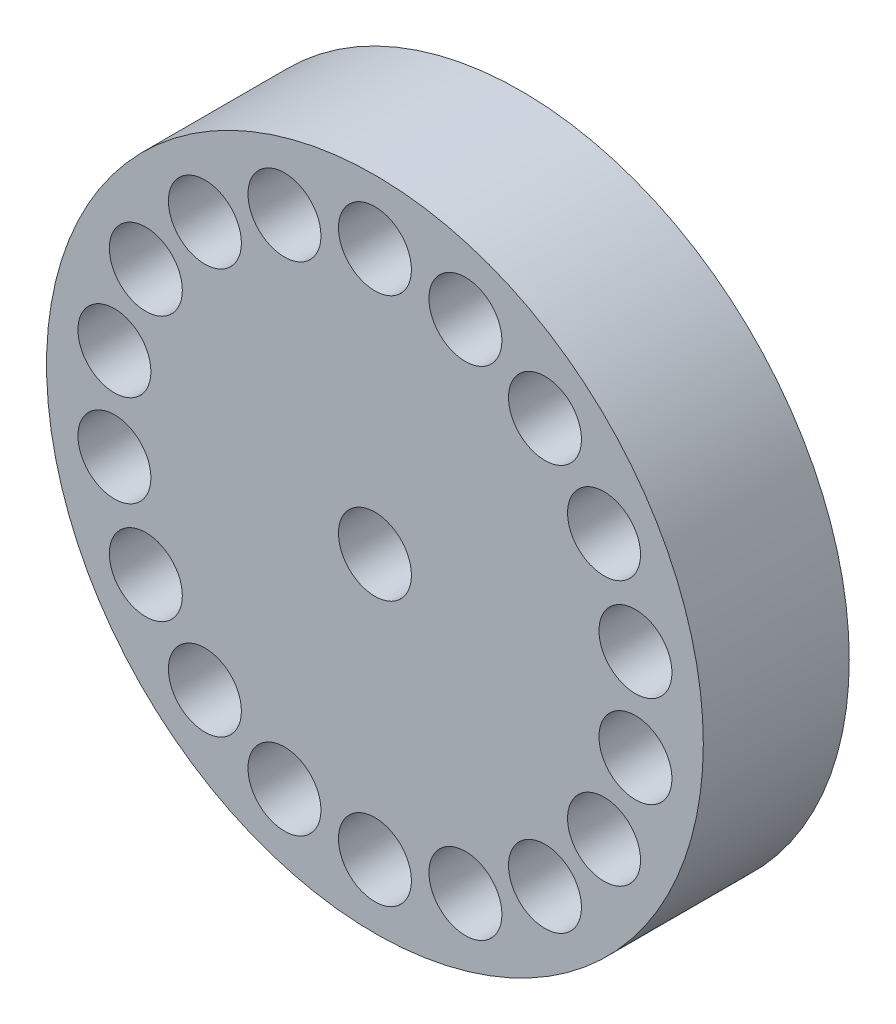
ISO-10303-21;
HEADER;
FILE_DESCRIPTION(('STEP AP214'),'2;1');
FILE_NAME('part.step','',(''),(''),'','','');
FILE_SCHEMA(('AUTOMOTIVE_DESIGN { 1 0 10303 214 1 1 1 1 }'));
ENDSEC;
DATA;
#1=APPLICATION_CONTEXT('core data for automotive mechanical design processes');
#2=APPLICATION_PROTOCOL_DEFINITION('international standard','automotive_design',2000,#1);
#3=PRODUCT_CONTEXT('',#1,'mechanical');
#4=PRODUCT('Part','Part','',(#3));
#5=PRODUCT_RELATED_PRODUCT_CATEGORY('part','',(#4));
#6=PRODUCT_DEFINITION_FORMATION('','',#4);
#7=PRODUCT_DEFINITION_CONTEXT('part definition',#1,'design');
#8=PRODUCT_DEFINITION('design','',#6,#7);
#9=PRODUCT_DEFINITION_SHAPE('','',#8);
#10=(LENGTH_UNIT() NAMED_UNIT(*) SI_UNIT(.MILLI.,.METRE.));
#11=(NAMED_UNIT(*) PLANE_ANGLE_UNIT() SI_UNIT($,.RADIAN.));
#12=(NAMED_UNIT(*) SI_UNIT($,.STERADIAN.) SOLID_ANGLE_UNIT());
#13=UNCERTAINTY_MEASURE_WITH_UNIT(LENGTH_MEASURE(1.E-05),#10,'distance_accuracy_value','');
#14=(GEOMETRIC_REPRESENTATION_CONTEXT(3) GLOBAL_UNCERTAINTY_ASSIGNED_CONTEXT((#13)) GLOBAL_UNIT_ASSIGNED_CONTEXT((#10,
#11,#12)) REPRESENTATION_CONTEXT('',''));
#15=CARTESIAN_POINT('',(0.,0.,0.));
#16=DIRECTION('',(0.,0.,1.));
#17=DIRECTION('',(1.,0.,0.));
#18=AXIS2_PLACEMENT_3D('',#15,#16,#17);
#19=CARTESIAN_POINT('',(0.,0.,2.));
#20=DIRECTION('',(0.,0.,1.));
#21=DIRECTION('',(1.,0.,0.));
#22=AXIS2_PLACEMENT_3D('',#19,#20,#21);
#23=PLANE('',#22);
#24=CARTESIAN_POINT('',(3.56992810466938,0.629474644042774,2.));
#25=DIRECTION('',(0.,0.,1.));
#26=DIRECTION('',(1.,0.,0.));
#27=AXIS2_PLACEMENT_3D('',#24,#25,#26);
#28=CIRCLE('',#27,0.500000000000088);
#29=CARTESIAN_POINT('',(4.06992810466947,0.629474644042774,2.));
#30=VERTEX_POINT('',#29);
#31=EDGE_CURVE('E119',#30,#30,#28,.T.);
#32=ORIENTED_EDGE('',*,*,#31,.F.);
#33=EDGE_LOOP('',(#32));
#34=FACE_BOUND('',#33,.T.);
#35=CARTESIAN_POINT('',(3.13934208871867,1.81250000000013,2.));
#36=DIRECTION('',(0.,0.,1.));
#37=DIRECTION('',(1.,0.,0.));
#38=AXIS2_PLACEMENT_3D('',#35,#36,#37);
#39=CIRCLE('',#38,0.500000000000043);
#40=CARTESIAN_POINT('',(3.63934208871871,1.81250000000013,2.));
#41=VERTEX_POINT('',#40);
#42=EDGE_CURVE('E147',#41,#41,#39,.T.);
#43=ORIENTED_EDGE('',*,*,#42,.F.);
#44=EDGE_LOOP('',(#43));
#45=FACE_BOUND('',#44,.T.);
#46=CARTESIAN_POINT('',(2.33010508511374,2.77691110630639,2.));
#47=DIRECTION('',(0.,0.,1.));
#48=DIRECTION('',(1.,0.,0.));
#49=AXIS2_PLACEMENT_3D('',#46,#47,#48);
#50=CIRCLE('',#49,0.500000000000011);
#51=CARTESIAN_POINT('',(2.83010508511375,2.77691110630639,2.));
#52=VERTEX_POINT('',#51);
#53=EDGE_CURVE('E130',#52,#52,#50,.T.);
#54=ORIENTED_EDGE('',*,*,#53,.F.);
#55=EDGE_LOOP('',(#54));
#56=FACE_BOUND('',#55,.T.);
#57=CARTESIAN_POINT('',(1.23982301955555,3.40638575034892,2.));
#58=DIRECTION('',(0.,0.,1.));
#59=DIRECTION('',(1.,0.,0.));
#60=AXIS2_PLACEMENT_3D('',#57,#58,#59);
#61=CIRCLE('',#60,0.5);
#62=CARTESIAN_POINT('',(1.73982301955555,3.40638575034892,2.));
#63=VERTEX_POINT('',#62);
#64=EDGE_CURVE('E137',#63,#63,#61,.T.);
#65=ORIENTED_EDGE('',*,*,#64,.F.);
#66=EDGE_LOOP('',(#65));
#67=FACE_BOUND('',#66,.T.);
#68=CARTESIAN_POINT('',(1.23982301955585,-3.40638575034887,2.));
#69=DIRECTION('',(0.,0.,1.));
#70=DIRECTION('',(1.,0.,0.));
#71=AXIS2_PLACEMENT_3D('',#68,#69,#70);
#72=CIRCLE('',#71,0.500000000000292);
#73=CARTESIAN_POINT('',(1.73982301955614,-3.40638575034887,2.));
#74=VERTEX_POINT('',#73);
#75=EDGE_CURVE('E105',#74,#74,#72,.T.);
#76=ORIENTED_EDGE('',*,*,#75,.F.);
#77=EDGE_LOOP('',(#76));
#78=FACE_BOUND('',#77,.T.);
#79=CARTESIAN_POINT('',(2.33010508511398,-2.7769111063062,2.));
#80=DIRECTION('',(0.,0.,1.));
#81=DIRECTION('',(1.,0.,0.));
#82=AXIS2_PLACEMENT_3D('',#79,#80,#81);
#83=CIRCLE('',#82,0.50000000000025);
#84=CARTESIAN_POINT('',(2.83010508511423,-2.7769111063062,2.));
#85=VERTEX_POINT('',#84);
#86=EDGE_CURVE('E125',#85,#85,#83,.T.);
#87=ORIENTED_EDGE('',*,*,#86,.F.);
#88=EDGE_LOOP('',(#87));
#89=FACE_BOUND('',#88,.T.);
#90=CARTESIAN_POINT('',(3.13934208871882,-1.81249999999987,2.));
#91=DIRECTION('',(0.,0.,1.));
#92=DIRECTION('',(1.,0.,0.));
#93=AXIS2_PLACEMENT_3D('',#90,#91,#92);
#94=CIRCLE('',#93,0.500000000000199);
#95=CARTESIAN_POINT('',(3.63934208871902,-1.81249999999987,2.));
#96=VERTEX_POINT('',#95);
#97=EDGE_CURVE('E106',#96,#96,#94,.T.);
#98=ORIENTED_EDGE('',*,*,#97,.F.);
#99=EDGE_LOOP('',(#98));
#100=FACE_BOUND('',#99,.T.);
#101=CARTESIAN_POINT('',(3.56992810466943,-0.629474644042471,2.));
#102=DIRECTION('',(0.,0.,1.));
#103=DIRECTION('',(1.,0.,0.));
#104=AXIS2_PLACEMENT_3D('',#101,#102,#103);
#105=CIRCLE('',#104,0.500000000000141);
#106=CARTESIAN_POINT('',(4.06992810466958,-0.629474644042471,2.));
#107=VERTEX_POINT('',#106);
#108=EDGE_CURVE('E113',#107,#107,#105,.T.);
#109=ORIENTED_EDGE('',*,*,#108,.F.);
#110=EDGE_LOOP('',(#109));
#111=FACE_BOUND('',#110,.T.);
#112=CARTESIAN_POINT('',(3.07754286661571E-13,-3.625,2.));
#113=DIRECTION('',(0.,0.,1.));
#114=DIRECTION('',(1.,0.,0.));
#115=AXIS2_PLACEMENT_3D('',#112,#113,#114);
#116=CIRCLE('',#115,0.500000000000319);
#117=CARTESIAN_POINT('',(0.500000000000626,-3.625,2.));
#118=VERTEX_POINT('',#117);
#119=EDGE_CURVE('E99',#118,#118,#116,.T.);
#120=ORIENTED_EDGE('',*,*,#119,.F.);
#121=EDGE_LOOP('',(#120));
#122=FACE_BOUND('',#121,.T.);
#123=CARTESIAN_POINT('',(-1.23982301955525,-3.40638575034897,2.));
#124=DIRECTION('',(0.,0.,1.));
#125=DIRECTION('',(1.,0.,0.));
#126=AXIS2_PLACEMENT_3D('',#123,#124,#125);
#127=CIRCLE('',#126,0.500000000000326);
#128=CARTESIAN_POINT('',(-0.739823019554925,-3.40638575034897,2.));
#129=VERTEX_POINT('',#128);
#130=EDGE_CURVE('E89',#129,#129,#127,.T.);
#131=ORIENTED_EDGE('',*,*,#130,.F.);
#132=EDGE_LOOP('',(#131));
#133=FACE_BOUND('',#132,.T.);
#134=CARTESIAN_POINT('',(-3.13934208871836,-1.81250000000013,2.));
#135=DIRECTION('',(0.,0.,1.));
#136=DIRECTION('',(1.,0.,0.));
#137=AXIS2_PLACEMENT_3D('',#134,#135,#136);
#138=CIRCLE('',#137,0.500000000000293);
#139=CARTESIAN_POINT('',(-2.63934208871807,-1.81250000000013,2.));
#140=VERTEX_POINT('',#139);
#141=EDGE_CURVE('E81',#140,#140,#138,.T.);
#142=ORIENTED_EDGE('',*,*,#141,.F.);
#143=EDGE_LOOP('',(#142));
#144=FACE_BOUND('',#143,.T.);
#145=CARTESIAN_POINT('',(-2.33010508511343,-2.77691110630639,2.));
#146=DIRECTION('',(0.,0.,1.));
#147=DIRECTION('',(1.,0.,0.));
#148=AXIS2_PLACEMENT_3D('',#145,#146,#147);
#149=CIRCLE('',#148,0.500000000000317);
#150=CARTESIAN_POINT('',(-1.83010508511312,-2.77691110630639,2.));
#151=VERTEX_POINT('',#150);
#152=EDGE_CURVE('E82',#151,#151,#149,.T.);
#153=ORIENTED_EDGE('',*,*,#152,.F.);
#154=EDGE_LOOP('',(#153));
#155=FACE_BOUND('',#154,.T.);
#156=CARTESIAN_POINT('',(-3.56992810466907,-0.629474644042774,2.));
#157=DIRECTION('',(0.,0.,1.));
#158=DIRECTION('',(1.,0.,0.));
#159=AXIS2_PLACEMENT_3D('',#156,#157,#158);
#160=CIRCLE('',#159,0.500000000000251);
#161=CARTESIAN_POINT('',(-3.06992810466882,-0.629474644042774,2.));
#162=VERTEX_POINT('',#161);
#163=EDGE_CURVE('E75',#162,#162,#160,.T.);
#164=ORIENTED_EDGE('',*,*,#163,.F.);
#165=EDGE_LOOP('',(#164));
#166=FACE_BOUND('',#165,.T.);
#167=CARTESIAN_POINT('',(-3.56992810466913,0.62947464404247,2.));
#168=DIRECTION('',(0.,0.,1.));
#169=DIRECTION('',(1.,0.,0.));
#170=AXIS2_PLACEMENT_3D('',#167,#168,#169);
#171=CIRCLE('',#170,0.500000000000202);
#172=CARTESIAN_POINT('',(-3.06992810466893,0.62947464404247,2.));
#173=VERTEX_POINT('',#172);
#174=EDGE_CURVE('E63',#173,#173,#171,.T.);
#175=ORIENTED_EDGE('',*,*,#174,.F.);
#176=EDGE_LOOP('',(#175));
#177=FACE_BOUND('',#176,.T.);
#178=CARTESIAN_POINT('',(-2.33010508511367,2.7769111063062,2.));
#179=DIRECTION('',(0.,0.,1.));
#180=DIRECTION('',(1.,0.,0.));
#181=AXIS2_PLACEMENT_3D('',#178,#179,#180);
#182=CIRCLE('',#181,0.500000000000108);
#183=CARTESIAN_POINT('',(-1.83010508511356,2.7769111063062,2.));
#184=VERTEX_POINT('',#183);
#185=EDGE_CURVE('E64',#184,#184,#182,.T.);
#186=ORIENTED_EDGE('',*,*,#185,.F.);
#187=EDGE_LOOP('',(#186));
#188=FACE_BOUND('',#187,.T.);
#189=CARTESIAN_POINT('',(-3.13934208871851,1.81249999999987,2.));
#190=DIRECTION('',(0.,0.,1.));
#191=DIRECTION('',(1.,0.,0.));
#192=AXIS2_PLACEMENT_3D('',#189,#190,#191);
#193=CIRCLE('',#192,0.500000000000153);
#194=CARTESIAN_POINT('',(-2.63934208871836,1.81249999999987,2.));
#195=VERTEX_POINT('',#194);
#196=EDGE_CURVE('E56',#195,#195,#193,.T.);
#197=ORIENTED_EDGE('',*,*,#196,.F.);
#198=EDGE_LOOP('',(#197));
#199=FACE_BOUND('',#198,.T.);
#200=CARTESIAN_POINT('',(-1.23982301955551,3.40638575034893,2.));
#201=DIRECTION('',(0.,0.,1.));
#202=DIRECTION('',(1.,0.,0.));
#203=AXIS2_PLACEMENT_3D('',#200,#201,#202);
#204=CIRCLE('',#203,0.5);
#205=CARTESIAN_POINT('',(-0.739823019555507,3.40638575034893,2.));
#206=VERTEX_POINT('',#205);
#207=EDGE_CURVE('E152',#206,#206,#204,.T.);
#208=ORIENTED_EDGE('',*,*,#207,.F.);
#209=EDGE_LOOP('',(#208));
#210=FACE_BOUND('',#209,.T.);
#211=CARTESIAN_POINT('',(0.,3.625,2.));
#212=DIRECTION('',(0.,0.,1.));
#213=DIRECTION('',(1.,0.,0.));
#214=AXIS2_PLACEMENT_3D('',#211,#212,#213);
#215=CIRCLE('',#214,0.5);
#216=CARTESIAN_POINT('',(0.5,3.625,2.));
#217=VERTEX_POINT('',#216);
#218=EDGE_CURVE('E50',#217,#217,#215,.T.);
#219=ORIENTED_EDGE('',*,*,#218,.F.);
#220=EDGE_LOOP('',(#219));
#221=FACE_BOUND('',#220,.T.);
#222=CARTESIAN_POINT('',(0.,0.,2.));
#223=DIRECTION('',(0.,0.,1.));
#224=DIRECTION('',(1.,0.,0.));
#225=AXIS2_PLACEMENT_3D('',#222,#223,#224);
#226=CIRCLE('',#225,4.5);
#227=CARTESIAN_POINT('',(4.5,0.,2.));
#228=VERTEX_POINT('',#227);
#229=EDGE_CURVE('E10',#228,#228,#226,.T.);
#230=ORIENTED_EDGE('',*,*,#229,.T.);
#231=EDGE_LOOP('',(#230));
#232=FACE_BOUND('',#231,.T.);
#233=CARTESIAN_POINT('',(0.,0.,2.));
#234=DIRECTION('',(0.,0.,1.));
#235=DIRECTION('',(1.,0.,0.));
#236=AXIS2_PLACEMENT_3D('',#233,#234,#235);
#237=CIRCLE('',#236,0.5);
#238=CARTESIAN_POINT('',(0.5,0.,2.));
#239=VERTEX_POINT('',#238);
#240=EDGE_CURVE('E42',#239,#239,#237,.T.);
#241=ORIENTED_EDGE('',*,*,#240,.F.);
#242=EDGE_LOOP('',(#241));
#243=FACE_BOUND('',#242,.T.);
#244=ADVANCED_FACE('F31',(#34,#45,#56,#67,#78,#89,#100,#111,#122,#133,#144,#155,#166,#177,#188,
#199,#210,#221,#232,#243),#23,.T.);
#245=CARTESIAN_POINT('',(0.,0.,0.));
#246=DIRECTION('',(0.,0.,1.));
#247=DIRECTION('',(1.,0.,0.));
#248=AXIS2_PLACEMENT_3D('',#245,#246,#247);
#249=PLANE('',#248);
#250=CARTESIAN_POINT('',(0.,0.,0.));
#251=DIRECTION('',(0.,0.,1.));
#252=DIRECTION('',(1.,0.,0.));
#253=AXIS2_PLACEMENT_3D('',#250,#251,#252);
#254=CIRCLE('',#253,4.5);
#255=CARTESIAN_POINT('',(4.5,0.,0.));
#256=VERTEX_POINT('',#255);
#257=EDGE_CURVE('E35',#256,#256,#254,.T.);
#258=ORIENTED_EDGE('',*,*,#257,.F.);
#259=EDGE_LOOP('',(#258));
#260=FACE_BOUND('',#259,.T.);
#261=CARTESIAN_POINT('',(0.,0.,0.));
#262=DIRECTION('',(0.,0.,1.));
#263=DIRECTION('',(1.,0.,0.));
#264=AXIS2_PLACEMENT_3D('',#261,#262,#263);
#265=CIRCLE('',#264,0.5);
#266=CARTESIAN_POINT('',(0.5,0.,0.));
#267=VERTEX_POINT('',#266);
#268=EDGE_CURVE('E44',#267,#267,#265,.T.);
#269=ORIENTED_EDGE('',*,*,#268,.T.);
#270=EDGE_LOOP('',(#269));
#271=FACE_BOUND('',#270,.T.);
#272=ADVANCED_FACE('F169',(#260,#271),#249,.F.);
#273=CARTESIAN_POINT('',(0.,0.,2.));
#274=DIRECTION('',(0.,0.,-1.));
#275=DIRECTION('',(-1.,0.,0.));
#276=AXIS2_PLACEMENT_3D('',#273,#274,#275);
#277=CYLINDRICAL_SURFACE('',#276,4.5);
#278=ORIENTED_EDGE('',*,*,#229,.F.);
#279=EDGE_LOOP('',(#278));
#280=FACE_BOUND('',#279,.T.);
#281=ORIENTED_EDGE('',*,*,#257,.T.);
#282=EDGE_LOOP('',(#281));
#283=FACE_BOUND('',#282,.T.);
#284=ADVANCED_FACE('F33',(#280,#283),#277,.T.);
#285=CARTESIAN_POINT('',(0.,0.,2.));
#286=DIRECTION('',(0.,0.,-1.));
#287=DIRECTION('',(-1.,0.,0.));
#288=AXIS2_PLACEMENT_3D('',#285,#286,#287);
#289=CYLINDRICAL_SURFACE('',#288,0.5);
#290=ORIENTED_EDGE('',*,*,#240,.T.);
#291=EDGE_LOOP('',(#290));
#292=FACE_BOUND('',#291,.T.);
#293=ORIENTED_EDGE('',*,*,#268,.F.);
#294=EDGE_LOOP('',(#293));
#295=FACE_BOUND('',#294,.T.);
#296=ADVANCED_FACE('F176',(#292,#295),#289,.F.);
#297=CARTESIAN_POINT('',(0.,3.625,1.));
#298=DIRECTION('',(0.,0.,1.));
#299=DIRECTION('',(1.,0.,0.));
#300=AXIS2_PLACEMENT_3D('',#297,#298,#299);
#301=CYLINDRICAL_SURFACE('',#300,0.5);
#302=CARTESIAN_POINT('',(0.,3.625,1.));
#303=DIRECTION('',(0.,0.,1.));
#304=DIRECTION('',(1.,0.,0.));
#305=AXIS2_PLACEMENT_3D('',#302,#303,#304);
#306=CIRCLE('',#305,0.5);
#307=CARTESIAN_POINT('',(0.5,3.625,1.));
#308=VERTEX_POINT('',#307);
#309=EDGE_CURVE('E47',#308,#308,#306,.T.);
#310=ORIENTED_EDGE('',*,*,#309,.F.);
#311=EDGE_LOOP('',(#310));
#312=FACE_BOUND('',#311,.T.);
#313=ORIENTED_EDGE('',*,*,#218,.T.);
#314=EDGE_LOOP('',(#313));
#315=FACE_BOUND('',#314,.T.);
#316=ADVANCED_FACE('F179',(#312,#315),#301,.F.);
#317=CARTESIAN_POINT('',(0.,3.625,1.));
#318=DIRECTION('',(0.,0.,1.));
#319=DIRECTION('',(1.,0.,0.));
#320=AXIS2_PLACEMENT_3D('',#317,#318,#319);
#321=PLANE('',#320);
#322=ORIENTED_EDGE('',*,*,#309,.T.);
#323=EDGE_LOOP('',(#322));
#324=FACE_BOUND('',#323,.T.);
#325=ADVANCED_FACE('F163',(#324),#321,.T.);
#326=CARTESIAN_POINT('',(-1.23982301955551,3.40638575034893,1.));
#327=DIRECTION('',(0.,0.,1.));
#328=DIRECTION('',(1.,0.,0.));
#329=AXIS2_PLACEMENT_3D('',#326,#327,#328);
#330=CYLINDRICAL_SURFACE('',#329,0.5);
#331=CARTESIAN_POINT('',(-1.23982301955551,3.40638575034893,1.));
#332=DIRECTION('',(0.,0.,1.));
#333=DIRECTION('',(1.,0.,0.));
#334=AXIS2_PLACEMENT_3D('',#331,#332,#333);
#335=CIRCLE('',#334,0.5);
#336=CARTESIAN_POINT('',(-0.739823019555507,3.40638575034893,1.));
#337=VERTEX_POINT('',#336);
#338=EDGE_CURVE('E67',#337,#337,#335,.T.);
#339=ORIENTED_EDGE('',*,*,#338,.F.);
#340=EDGE_LOOP('',(#339));
#341=FACE_BOUND('',#340,.T.);
#342=ORIENTED_EDGE('',*,*,#207,.T.);
#343=EDGE_LOOP('',(#342));
#344=FACE_BOUND('',#343,.T.);
#345=ADVANCED_FACE('F160',(#341,#344),#330,.F.);
#346=CARTESIAN_POINT('',(-1.23982301955551,3.40638575034893,1.));
#347=DIRECTION('',(0.,0.,1.));
#348=DIRECTION('',(1.,0.,0.));
#349=AXIS2_PLACEMENT_3D('',#346,#347,#348);
#350=PLANE('',#349);
#351=ORIENTED_EDGE('',*,*,#338,.T.);
#352=EDGE_LOOP('',(#351));
#353=FACE_BOUND('',#352,.T.);
#354=ADVANCED_FACE('F158',(#353),#350,.T.);
#355=CARTESIAN_POINT('',(-3.13934208871851,1.81249999999987,1.));
#356=DIRECTION('',(0.,0.,1.));
#357=DIRECTION('',(1.,0.,0.));
#358=AXIS2_PLACEMENT_3D('',#355,#356,#357);
#359=CYLINDRICAL_SURFACE('',#358,0.500000000000153);
#360=CARTESIAN_POINT('',(-3.13934208871851,1.81249999999987,1.));
#361=DIRECTION('',(0.,0.,1.));
#362=DIRECTION('',(1.,0.,0.));
#363=AXIS2_PLACEMENT_3D('',#360,#361,#362);
#364=CIRCLE('',#363,0.500000000000153);
#365=CARTESIAN_POINT('',(-2.63934208871836,1.81249999999987,1.));
#366=VERTEX_POINT('',#365);
#367=EDGE_CURVE('E59',#366,#366,#364,.T.);
#368=ORIENTED_EDGE('',*,*,#367,.F.);
#369=EDGE_LOOP('',(#368));
#370=FACE_BOUND('',#369,.T.);
#371=ORIENTED_EDGE('',*,*,#196,.T.);
#372=EDGE_LOOP('',(#371));
#373=FACE_BOUND('',#372,.T.);
#374=ADVANCED_FACE('F197',(#370,#373),#359,.F.);
#375=CARTESIAN_POINT('',(-3.13934208871851,1.81249999999987,1.));
#376=DIRECTION('',(0.,0.,1.));
#377=DIRECTION('',(1.,0.,0.));
#378=AXIS2_PLACEMENT_3D('',#375,#376,#377);
#379=PLANE('',#378);
#380=ORIENTED_EDGE('',*,*,#367,.T.);
#381=EDGE_LOOP('',(#380));
#382=FACE_BOUND('',#381,.T.);
#383=ADVANCED_FACE('F200',(#382),#379,.T.);
#384=CARTESIAN_POINT('',(-2.33010508511367,2.7769111063062,1.));
#385=DIRECTION('',(0.,0.,1.));
#386=DIRECTION('',(1.,0.,0.));
#387=AXIS2_PLACEMENT_3D('',#384,#385,#386);
#388=CYLINDRICAL_SURFACE('',#387,0.500000000000108);
#389=CARTESIAN_POINT('',(-2.33010508511367,2.7769111063062,1.));
#390=DIRECTION('',(0.,0.,1.));
#391=DIRECTION('',(1.,0.,0.));
#392=AXIS2_PLACEMENT_3D('',#389,#390,#391);
#393=CIRCLE('',#392,0.500000000000108);
#394=CARTESIAN_POINT('',(-1.83010508511356,2.7769111063062,1.));
#395=VERTEX_POINT('',#394);
#396=EDGE_CURVE('E60',#395,#395,#393,.T.);
#397=ORIENTED_EDGE('',*,*,#396,.F.);
#398=EDGE_LOOP('',(#397));
#399=FACE_BOUND('',#398,.T.);
#400=ORIENTED_EDGE('',*,*,#185,.T.);
#401=EDGE_LOOP('',(#400));
#402=FACE_BOUND('',#401,.T.);
#403=ADVANCED_FACE('F204',(#399,#402),#388,.F.);
#404=CARTESIAN_POINT('',(-2.33010508511367,2.7769111063062,1.));
#405=DIRECTION('',(0.,0.,1.));
#406=DIRECTION('',(1.,0.,0.));
#407=AXIS2_PLACEMENT_3D('',#404,#405,#406);
#408=PLANE('',#407);
#409=ORIENTED_EDGE('',*,*,#396,.T.);
#410=EDGE_LOOP('',(#409));
#411=FACE_BOUND('',#410,.T.);
#412=ADVANCED_FACE('F208',(#411),#408,.T.);
#413=CARTESIAN_POINT('',(-3.56992810466913,0.62947464404247,1.));
#414=DIRECTION('',(0.,0.,1.));
#415=DIRECTION('',(1.,0.,0.));
#416=AXIS2_PLACEMENT_3D('',#413,#414,#415);
#417=CYLINDRICAL_SURFACE('',#416,0.500000000000202);
#418=CARTESIAN_POINT('',(-3.56992810466913,0.62947464404247,1.));
#419=DIRECTION('',(0.,0.,1.));
#420=DIRECTION('',(1.,0.,0.));
#421=AXIS2_PLACEMENT_3D('',#418,#419,#420);
#422=CIRCLE('',#421,0.500000000000202);
#423=CARTESIAN_POINT('',(-3.06992810466893,0.62947464404247,1.));
#424=VERTEX_POINT('',#423);
#425=EDGE_CURVE('E72',#424,#424,#422,.T.);
#426=ORIENTED_EDGE('',*,*,#425,.F.);
#427=EDGE_LOOP('',(#426));
#428=FACE_BOUND('',#427,.T.);
#429=ORIENTED_EDGE('',*,*,#174,.T.);
#430=EDGE_LOOP('',(#429));
#431=FACE_BOUND('',#430,.T.);
#432=ADVANCED_FACE('F212',(#428,#431),#417,.F.);
#433=CARTESIAN_POINT('',(-3.56992810466913,0.62947464404247,1.));
#434=DIRECTION('',(0.,0.,1.));
#435=DIRECTION('',(1.,0.,0.));
#436=AXIS2_PLACEMENT_3D('',#433,#434,#435);
#437=PLANE('',#436);
#438=ORIENTED_EDGE('',*,*,#425,.T.);
#439=EDGE_LOOP('',(#438));
#440=FACE_BOUND('',#439,.T.);
#441=ADVANCED_FACE('F216',(#440),#437,.T.);
#442=CARTESIAN_POINT('',(-3.56992810466907,-0.629474644042774,1.));
#443=DIRECTION('',(0.,0.,1.));
#444=DIRECTION('',(1.,0.,0.));
#445=AXIS2_PLACEMENT_3D('',#442,#443,#444);
#446=CYLINDRICAL_SURFACE('',#445,0.500000000000251);
#447=CARTESIAN_POINT('',(-3.56992810466907,-0.629474644042774,1.));
#448=DIRECTION('',(0.,0.,1.));
#449=DIRECTION('',(1.,0.,0.));
#450=AXIS2_PLACEMENT_3D('',#447,#448,#449);
#451=CIRCLE('',#450,0.500000000000251);
#452=CARTESIAN_POINT('',(-3.06992810466882,-0.629474644042774,1.));
#453=VERTEX_POINT('',#452);
#454=EDGE_CURVE('E78',#453,#453,#451,.T.);
#455=ORIENTED_EDGE('',*,*,#454,.F.);
#456=EDGE_LOOP('',(#455));
#457=FACE_BOUND('',#456,.T.);
#458=ORIENTED_EDGE('',*,*,#163,.T.);
#459=EDGE_LOOP('',(#458));
#460=FACE_BOUND('',#459,.T.);
#461=ADVANCED_FACE('F220',(#457,#460),#446,.F.);
#462=CARTESIAN_POINT('',(-3.56992810466907,-0.629474644042774,1.));
#463=DIRECTION('',(0.,0.,1.));
#464=DIRECTION('',(1.,0.,0.));
#465=AXIS2_PLACEMENT_3D('',#462,#463,#464);
#466=PLANE('',#465);
#467=ORIENTED_EDGE('',*,*,#454,.T.);
#468=EDGE_LOOP('',(#467));
#469=FACE_BOUND('',#468,.T.);
#470=ADVANCED_FACE('F224',(#469),#466,.T.);
#471=CARTESIAN_POINT('',(-2.33010508511343,-2.77691110630639,1.));
#472=DIRECTION('',(0.,0.,1.));
#473=DIRECTION('',(1.,0.,0.));
#474=AXIS2_PLACEMENT_3D('',#471,#472,#473);
#475=CYLINDRICAL_SURFACE('',#474,0.500000000000317);
#476=CARTESIAN_POINT('',(-2.33010508511343,-2.77691110630639,1.));
#477=DIRECTION('',(0.,0.,1.));
#478=DIRECTION('',(1.,0.,0.));
#479=AXIS2_PLACEMENT_3D('',#476,#477,#478);
#480=CIRCLE('',#479,0.500000000000317);
#481=CARTESIAN_POINT('',(-1.83010508511312,-2.77691110630639,1.));
#482=VERTEX_POINT('',#481);
#483=EDGE_CURVE('E85',#482,#482,#480,.T.);
#484=ORIENTED_EDGE('',*,*,#483,.F.);
#485=EDGE_LOOP('',(#484));
#486=FACE_BOUND('',#485,.T.);
#487=ORIENTED_EDGE('',*,*,#152,.T.);
#488=EDGE_LOOP('',(#487));
#489=FACE_BOUND('',#488,.T.);
#490=ADVANCED_FACE('F228',(#486,#489),#475,.F.);
#491=CARTESIAN_POINT('',(-2.33010508511343,-2.77691110630639,1.));
#492=DIRECTION('',(0.,0.,1.));
#493=DIRECTION('',(1.,0.,0.));
#494=AXIS2_PLACEMENT_3D('',#491,#492,#493);
#495=PLANE('',#494);
#496=ORIENTED_EDGE('',*,*,#483,.T.);
#497=EDGE_LOOP('',(#496));
#498=FACE_BOUND('',#497,.T.);
#499=ADVANCED_FACE('F232',(#498),#495,.T.);
#500=CARTESIAN_POINT('',(-3.13934208871836,-1.81250000000013,1.));
#501=DIRECTION('',(0.,0.,1.));
#502=DIRECTION('',(1.,0.,0.));
#503=AXIS2_PLACEMENT_3D('',#500,#501,#502);
#504=CYLINDRICAL_SURFACE('',#503,0.500000000000293);
#505=CARTESIAN_POINT('',(-3.13934208871836,-1.81250000000013,1.));
#506=DIRECTION('',(0.,0.,1.));
#507=DIRECTION('',(1.,0.,0.));
#508=AXIS2_PLACEMENT_3D('',#505,#506,#507);
#509=CIRCLE('',#508,0.500000000000293);
#510=CARTESIAN_POINT('',(-2.63934208871807,-1.81250000000013,1.));
#511=VERTEX_POINT('',#510);
#512=EDGE_CURVE('E86',#511,#511,#509,.T.);
#513=ORIENTED_EDGE('',*,*,#512,.F.);
#514=EDGE_LOOP('',(#513));
#515=FACE_BOUND('',#514,.T.);
#516=ORIENTED_EDGE('',*,*,#141,.T.);
#517=EDGE_LOOP('',(#516));
#518=FACE_BOUND('',#517,.T.);
#519=ADVANCED_FACE('F236',(#515,#518),#504,.F.);
#520=CARTESIAN_POINT('',(-3.13934208871836,-1.81250000000013,1.));
#521=DIRECTION('',(0.,0.,1.));
#522=DIRECTION('',(1.,0.,0.));
#523=AXIS2_PLACEMENT_3D('',#520,#521,#522);
#524=PLANE('',#523);
#525=ORIENTED_EDGE('',*,*,#512,.T.);
#526=EDGE_LOOP('',(#525));
#527=FACE_BOUND('',#526,.T.);
#528=ADVANCED_FACE('F240',(#527),#524,.T.);
#529=CARTESIAN_POINT('',(-1.23982301955525,-3.40638575034897,1.));
#530=DIRECTION('',(0.,0.,1.));
#531=DIRECTION('',(1.,0.,0.));
#532=AXIS2_PLACEMENT_3D('',#529,#530,#531);
#533=CYLINDRICAL_SURFACE('',#532,0.500000000000326);
#534=CARTESIAN_POINT('',(-1.23982301955525,-3.40638575034897,1.));
#535=DIRECTION('',(0.,0.,1.));
#536=DIRECTION('',(1.,0.,0.));
#537=AXIS2_PLACEMENT_3D('',#534,#535,#536);
#538=CIRCLE('',#537,0.500000000000326);
#539=CARTESIAN_POINT('',(-0.739823019554925,-3.40638575034897,1.));
#540=VERTEX_POINT('',#539);
#541=EDGE_CURVE('E96',#540,#540,#538,.T.);
#542=ORIENTED_EDGE('',*,*,#541,.F.);
#543=EDGE_LOOP('',(#542));
#544=FACE_BOUND('',#543,.T.);
#545=ORIENTED_EDGE('',*,*,#130,.T.);
#546=EDGE_LOOP('',(#545));
#547=FACE_BOUND('',#546,.T.);
#548=ADVANCED_FACE('F244',(#544,#547),#533,.F.);
#549=CARTESIAN_POINT('',(-1.23982301955525,-3.40638575034897,1.));
#550=DIRECTION('',(0.,0.,1.));
#551=DIRECTION('',(1.,0.,0.));
#552=AXIS2_PLACEMENT_3D('',#549,#550,#551);
#553=PLANE('',#552);
#554=ORIENTED_EDGE('',*,*,#541,.T.);
#555=EDGE_LOOP('',(#554));
#556=FACE_BOUND('',#555,.T.);
#557=ADVANCED_FACE('F248',(#556),#553,.T.);
#558=CARTESIAN_POINT('',(3.07754286661571E-13,-3.625,1.));
#559=DIRECTION('',(0.,0.,1.));
#560=DIRECTION('',(1.,0.,0.));
#561=AXIS2_PLACEMENT_3D('',#558,#559,#560);
#562=CYLINDRICAL_SURFACE('',#561,0.500000000000319);
#563=CARTESIAN_POINT('',(3.07754286661571E-13,-3.625,1.));
#564=DIRECTION('',(0.,0.,1.));
#565=DIRECTION('',(1.,0.,0.));
#566=AXIS2_PLACEMENT_3D('',#563,#564,#565);
#567=CIRCLE('',#566,0.500000000000319);
#568=CARTESIAN_POINT('',(0.500000000000626,-3.625,1.));
#569=VERTEX_POINT('',#568);
#570=EDGE_CURVE('E102',#569,#569,#567,.T.);
#571=ORIENTED_EDGE('',*,*,#570,.F.);
#572=EDGE_LOOP('',(#571));
#573=FACE_BOUND('',#572,.T.);
#574=ORIENTED_EDGE('',*,*,#119,.T.);
#575=EDGE_LOOP('',(#574));
#576=FACE_BOUND('',#575,.T.);
#577=ADVANCED_FACE('F252',(#573,#576),#562,.F.);
#578=CARTESIAN_POINT('',(3.07754286661571E-13,-3.625,1.));
#579=DIRECTION('',(0.,0.,1.));
#580=DIRECTION('',(1.,0.,0.));
#581=AXIS2_PLACEMENT_3D('',#578,#579,#580);
#582=PLANE('',#581);
#583=ORIENTED_EDGE('',*,*,#570,.T.);
#584=EDGE_LOOP('',(#583));
#585=FACE_BOUND('',#584,.T.);
#586=ADVANCED_FACE('F256',(#585),#582,.T.);
#587=CARTESIAN_POINT('',(3.56992810466943,-0.629474644042471,1.));
#588=DIRECTION('',(0.,0.,1.));
#589=DIRECTION('',(1.,0.,0.));
#590=AXIS2_PLACEMENT_3D('',#587,#588,#589);
#591=CYLINDRICAL_SURFACE('',#590,0.500000000000141);
#592=CARTESIAN_POINT('',(3.56992810466943,-0.629474644042471,1.));
#593=DIRECTION('',(0.,0.,1.));
#594=DIRECTION('',(1.,0.,0.));
#595=AXIS2_PLACEMENT_3D('',#592,#593,#594);
#596=CIRCLE('',#595,0.500000000000141);
#597=CARTESIAN_POINT('',(4.06992810466958,-0.629474644042471,1.));
#598=VERTEX_POINT('',#597);
#599=EDGE_CURVE('E116',#598,#598,#596,.T.);
#600=ORIENTED_EDGE('',*,*,#599,.F.);
#601=EDGE_LOOP('',(#600));
#602=FACE_BOUND('',#601,.T.);
#603=ORIENTED_EDGE('',*,*,#108,.T.);
#604=EDGE_LOOP('',(#603));
#605=FACE_BOUND('',#604,.T.);
#606=ADVANCED_FACE('F260',(#602,#605),#591,.F.);
#607=CARTESIAN_POINT('',(3.56992810466943,-0.629474644042471,1.));
#608=DIRECTION('',(0.,0.,1.));
#609=DIRECTION('',(1.,0.,0.));
#610=AXIS2_PLACEMENT_3D('',#607,#608,#609);
#611=PLANE('',#610);
#612=ORIENTED_EDGE('',*,*,#599,.T.);
#613=EDGE_LOOP('',(#612));
#614=FACE_BOUND('',#613,.T.);
#615=ADVANCED_FACE('F266',(#614),#611,.T.);
#616=CARTESIAN_POINT('',(3.13934208871882,-1.81249999999987,1.));
#617=DIRECTION('',(0.,0.,1.));
#618=DIRECTION('',(1.,0.,0.));
#619=AXIS2_PLACEMENT_3D('',#616,#617,#618);
#620=CYLINDRICAL_SURFACE('',#619,0.500000000000199);
#621=CARTESIAN_POINT('',(3.13934208871882,-1.81249999999987,1.));
#622=DIRECTION('',(0.,0.,1.));
#623=DIRECTION('',(1.,0.,0.));
#624=AXIS2_PLACEMENT_3D('',#621,#622,#623);
#625=CIRCLE('',#624,0.500000000000199);
#626=CARTESIAN_POINT('',(3.63934208871902,-1.81249999999987,1.));
#627=VERTEX_POINT('',#626);
#628=EDGE_CURVE('E109',#627,#627,#625,.T.);
#629=ORIENTED_EDGE('',*,*,#628,.F.);
#630=EDGE_LOOP('',(#629));
#631=FACE_BOUND('',#630,.T.);
#632=ORIENTED_EDGE('',*,*,#97,.T.);
#633=EDGE_LOOP('',(#632));
#634=FACE_BOUND('',#633,.T.);
#635=ADVANCED_FACE('F262',(#631,#634),#620,.F.);
#636=CARTESIAN_POINT('',(3.13934208871882,-1.81249999999987,1.));
#637=DIRECTION('',(0.,0.,1.));
#638=DIRECTION('',(1.,0.,0.));
#639=AXIS2_PLACEMENT_3D('',#636,#637,#638);
#640=PLANE('',#639);
#641=ORIENTED_EDGE('',*,*,#628,.T.);
#642=EDGE_LOOP('',(#641));
#643=FACE_BOUND('',#642,.T.);
#644=ADVANCED_FACE('F265',(#643),#640,.T.);
#645=CARTESIAN_POINT('',(2.33010508511398,-2.7769111063062,1.));
#646=DIRECTION('',(0.,0.,1.));
#647=DIRECTION('',(1.,0.,0.));
#648=AXIS2_PLACEMENT_3D('',#645,#646,#647);
#649=CYLINDRICAL_SURFACE('',#648,0.50000000000025);
#650=CARTESIAN_POINT('',(2.33010508511398,-2.7769111063062,1.));
#651=DIRECTION('',(0.,0.,1.));
#652=DIRECTION('',(1.,0.,0.));
#653=AXIS2_PLACEMENT_3D('',#650,#651,#652);
#654=CIRCLE('',#653,0.50000000000025);
#655=CARTESIAN_POINT('',(2.83010508511423,-2.7769111063062,1.));
#656=VERTEX_POINT('',#655);
#657=EDGE_CURVE('E110',#656,#656,#654,.T.);
#658=ORIENTED_EDGE('',*,*,#657,.F.);
#659=EDGE_LOOP('',(#658));
#660=FACE_BOUND('',#659,.T.);
#661=ORIENTED_EDGE('',*,*,#86,.T.);
#662=EDGE_LOOP('',(#661));
#663=FACE_BOUND('',#662,.T.);
#664=ADVANCED_FACE('F270',(#660,#663),#649,.F.);
#665=CARTESIAN_POINT('',(2.33010508511398,-2.7769111063062,1.));
#666=DIRECTION('',(0.,0.,1.));
#667=DIRECTION('',(1.,0.,0.));
#668=AXIS2_PLACEMENT_3D('',#665,#666,#667);
#669=PLANE('',#668);
#670=ORIENTED_EDGE('',*,*,#657,.T.);
#671=EDGE_LOOP('',(#670));
#672=FACE_BOUND('',#671,.T.);
#673=ADVANCED_FACE('F282',(#672),#669,.T.);
#674=CARTESIAN_POINT('',(1.23982301955585,-3.40638575034887,1.));
#675=DIRECTION('',(0.,0.,1.));
#676=DIRECTION('',(1.,0.,0.));
#677=AXIS2_PLACEMENT_3D('',#674,#675,#676);
#678=CYLINDRICAL_SURFACE('',#677,0.500000000000292);
#679=CARTESIAN_POINT('',(1.23982301955585,-3.40638575034887,1.));
#680=DIRECTION('',(0.,0.,1.));
#681=DIRECTION('',(1.,0.,0.));
#682=AXIS2_PLACEMENT_3D('',#679,#680,#681);
#683=CIRCLE('',#682,0.500000000000292);
#684=CARTESIAN_POINT('',(1.73982301955614,-3.40638575034887,1.));
#685=VERTEX_POINT('',#684);
#686=EDGE_CURVE('E122',#685,#685,#683,.T.);
#687=ORIENTED_EDGE('',*,*,#686,.F.);
#688=EDGE_LOOP('',(#687));
#689=FACE_BOUND('',#688,.T.);
#690=ORIENTED_EDGE('',*,*,#75,.T.);
#691=EDGE_LOOP('',(#690));
#692=FACE_BOUND('',#691,.T.);
#693=ADVANCED_FACE('F278',(#689,#692),#678,.F.);
#694=CARTESIAN_POINT('',(1.23982301955585,-3.40638575034887,1.));
#695=DIRECTION('',(0.,0.,1.));
#696=DIRECTION('',(1.,0.,0.));
#697=AXIS2_PLACEMENT_3D('',#694,#695,#696);
#698=PLANE('',#697);
#699=ORIENTED_EDGE('',*,*,#686,.T.);
#700=EDGE_LOOP('',(#699));
#701=FACE_BOUND('',#700,.T.);
#702=ADVANCED_FACE('F281',(#701),#698,.T.);
#703=CARTESIAN_POINT('',(1.23982301955555,3.40638575034892,1.));
#704=DIRECTION('',(0.,0.,1.));
#705=DIRECTION('',(1.,0.,0.));
#706=AXIS2_PLACEMENT_3D('',#703,#704,#705);
#707=CYLINDRICAL_SURFACE('',#706,0.5);
#708=CARTESIAN_POINT('',(1.23982301955555,3.40638575034892,1.));
#709=DIRECTION('',(0.,0.,1.));
#710=DIRECTION('',(1.,0.,0.));
#711=AXIS2_PLACEMENT_3D('',#708,#709,#710);
#712=CIRCLE('',#711,0.5);
#713=CARTESIAN_POINT('',(1.73982301955555,3.40638575034892,1.));
#714=VERTEX_POINT('',#713);
#715=EDGE_CURVE('E53',#714,#714,#712,.T.);
#716=ORIENTED_EDGE('',*,*,#715,.F.);
#717=EDGE_LOOP('',(#716));
#718=FACE_BOUND('',#717,.T.);
#719=ORIENTED_EDGE('',*,*,#64,.T.);
#720=EDGE_LOOP('',(#719));
#721=FACE_BOUND('',#720,.T.);
#722=ADVANCED_FACE('F286',(#718,#721),#707,.F.);
#723=CARTESIAN_POINT('',(1.23982301955555,3.40638575034892,1.));
#724=DIRECTION('',(0.,0.,1.));
#725=DIRECTION('',(1.,0.,0.));
#726=AXIS2_PLACEMENT_3D('',#723,#724,#725);
#727=PLANE('',#726);
#728=ORIENTED_EDGE('',*,*,#715,.T.);
#729=EDGE_LOOP('',(#728));
#730=FACE_BOUND('',#729,.T.);
#731=ADVANCED_FACE('F298',(#730),#727,.T.);
#732=CARTESIAN_POINT('',(2.33010508511374,2.77691110630639,1.));
#733=DIRECTION('',(0.,0.,1.));
#734=DIRECTION('',(1.,0.,0.));
#735=AXIS2_PLACEMENT_3D('',#732,#733,#734);
#736=CYLINDRICAL_SURFACE('',#735,0.500000000000011);
#737=CARTESIAN_POINT('',(2.33010508511374,2.77691110630639,1.));
#738=DIRECTION('',(0.,0.,1.));
#739=DIRECTION('',(1.,0.,0.));
#740=AXIS2_PLACEMENT_3D('',#737,#738,#739);
#741=CIRCLE('',#740,0.500000000000011);
#742=CARTESIAN_POINT('',(2.83010508511375,2.77691110630639,1.));
#743=VERTEX_POINT('',#742);
#744=EDGE_CURVE('E133',#743,#743,#741,.T.);
#745=ORIENTED_EDGE('',*,*,#744,.F.);
#746=EDGE_LOOP('',(#745));
#747=FACE_BOUND('',#746,.T.);
#748=ORIENTED_EDGE('',*,*,#53,.T.);
#749=EDGE_LOOP('',(#748));
#750=FACE_BOUND('',#749,.T.);
#751=ADVANCED_FACE('F294',(#747,#750),#736,.F.);
#752=CARTESIAN_POINT('',(2.33010508511374,2.77691110630639,1.));
#753=DIRECTION('',(0.,0.,1.));
#754=DIRECTION('',(1.,0.,0.));
#755=AXIS2_PLACEMENT_3D('',#752,#753,#754);
#756=PLANE('',#755);
#757=ORIENTED_EDGE('',*,*,#744,.T.);
#758=EDGE_LOOP('',(#757));
#759=FACE_BOUND('',#758,.T.);
#760=ADVANCED_FACE('F297',(#759),#756,.T.);
#761=CARTESIAN_POINT('',(3.13934208871867,1.81250000000013,1.));
#762=DIRECTION('',(0.,0.,1.));
#763=DIRECTION('',(1.,0.,0.));
#764=AXIS2_PLACEMENT_3D('',#761,#762,#763);
#765=CYLINDRICAL_SURFACE('',#764,0.500000000000043);
#766=CARTESIAN_POINT('',(3.13934208871867,1.81250000000013,1.));
#767=DIRECTION('',(0.,0.,1.));
#768=DIRECTION('',(1.,0.,0.));
#769=AXIS2_PLACEMENT_3D('',#766,#767,#768);
#770=CIRCLE('',#769,0.500000000000043);
#771=CARTESIAN_POINT('',(3.63934208871871,1.81250000000013,1.));
#772=VERTEX_POINT('',#771);
#773=EDGE_CURVE('E134',#772,#772,#770,.T.);
#774=ORIENTED_EDGE('',*,*,#773,.F.);
#775=EDGE_LOOP('',(#774));
#776=FACE_BOUND('',#775,.T.);
#777=ORIENTED_EDGE('',*,*,#42,.T.);
#778=EDGE_LOOP('',(#777));
#779=FACE_BOUND('',#778,.T.);
#780=ADVANCED_FACE('F302',(#776,#779),#765,.F.);
#781=CARTESIAN_POINT('',(3.13934208871867,1.81250000000013,1.));
#782=DIRECTION('',(0.,0.,1.));
#783=DIRECTION('',(1.,0.,0.));
#784=AXIS2_PLACEMENT_3D('',#781,#782,#783);
#785=PLANE('',#784);
#786=ORIENTED_EDGE('',*,*,#773,.T.);
#787=EDGE_LOOP('',(#786));
#788=FACE_BOUND('',#787,.T.);
#789=ADVANCED_FACE('F314',(#788),#785,.T.);
#790=CARTESIAN_POINT('',(3.56992810466938,0.629474644042774,1.));
#791=DIRECTION('',(0.,0.,1.));
#792=DIRECTION('',(1.,0.,0.));
#793=AXIS2_PLACEMENT_3D('',#790,#791,#792);
#794=CYLINDRICAL_SURFACE('',#793,0.500000000000088);
#795=CARTESIAN_POINT('',(3.56992810466938,0.629474644042774,1.));
#796=DIRECTION('',(0.,0.,1.));
#797=DIRECTION('',(1.,0.,0.));
#798=AXIS2_PLACEMENT_3D('',#795,#796,#797);
#799=CIRCLE('',#798,0.500000000000088);
#800=CARTESIAN_POINT('',(4.06992810466947,0.629474644042774,1.));
#801=VERTEX_POINT('',#800);
#802=EDGE_CURVE('E144',#801,#801,#799,.T.);
#803=ORIENTED_EDGE('',*,*,#802,.F.);
#804=EDGE_LOOP('',(#803));
#805=FACE_BOUND('',#804,.T.);
#806=ORIENTED_EDGE('',*,*,#31,.T.);
#807=EDGE_LOOP('',(#806));
#808=FACE_BOUND('',#807,.T.);
#809=ADVANCED_FACE('F310',(#805,#808),#794,.F.);
#810=CARTESIAN_POINT('',(3.56992810466938,0.629474644042774,1.));
#811=DIRECTION('',(0.,0.,1.));
#812=DIRECTION('',(1.,0.,0.));
#813=AXIS2_PLACEMENT_3D('',#810,#811,#812);
#814=PLANE('',#813);
#815=ORIENTED_EDGE('',*,*,#802,.T.);
#816=EDGE_LOOP('',(#815));
#817=FACE_BOUND('',#816,.T.);
#818=ADVANCED_FACE('F313',(#817),#814,.T.);
#819=CLOSED_SHELL('',(#244,#272,#284,#296,#316,#325,#345,#354,#374,#383,#403,#412,#432,#441,
#461,#470,#490,#499,#519,#528,#548,#557,#577,#586,#606,#615,#635,#644,#664,#673,#693,#702,#722,
#731,#751,#760,#780,#789,#809,#818));
#820=MANIFOLD_SOLID_BREP('B2',#819);
#821=ADVANCED_BREP_SHAPE_REPRESENTATION('',(#18,#820),#14);
#822=SHAPE_DEFINITION_REPRESENTATION(#9,#821);
ENDSEC;
END-ISO-10303-21;
